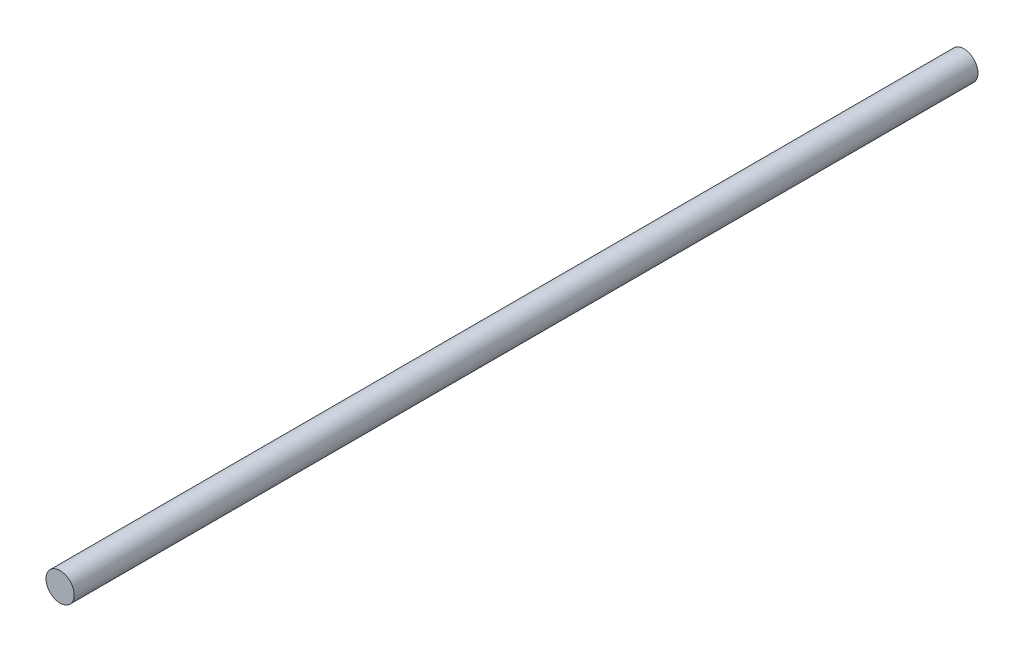
ISO-10303-21;
HEADER;
FILE_DESCRIPTION(('STEP AP214'),'2;1');
FILE_NAME('part.step','',(''),(''),'','','');
FILE_SCHEMA(('AUTOMOTIVE_DESIGN { 1 0 10303 214 1 1 1 1 }'));
ENDSEC;
DATA;
#1=APPLICATION_CONTEXT('core data for automotive mechanical design processes');
#2=APPLICATION_PROTOCOL_DEFINITION('international standard','automotive_design',2000,#1);
#3=PRODUCT_CONTEXT('',#1,'mechanical');
#4=PRODUCT('Part','Part','',(#3));
#5=PRODUCT_RELATED_PRODUCT_CATEGORY('part','',(#4));
#6=PRODUCT_DEFINITION_FORMATION('','',#4);
#7=PRODUCT_DEFINITION_CONTEXT('part definition',#1,'design');
#8=PRODUCT_DEFINITION('design','',#6,#7);
#9=PRODUCT_DEFINITION_SHAPE('','',#8);
#10=(LENGTH_UNIT() NAMED_UNIT(*) SI_UNIT(.MILLI.,.METRE.));
#11=(NAMED_UNIT(*) PLANE_ANGLE_UNIT() SI_UNIT($,.RADIAN.));
#12=(NAMED_UNIT(*) SI_UNIT($,.STERADIAN.) SOLID_ANGLE_UNIT());
#13=UNCERTAINTY_MEASURE_WITH_UNIT(LENGTH_MEASURE(1.E-05),#10,'distance_accuracy_value','');
#14=(GEOMETRIC_REPRESENTATION_CONTEXT(3) GLOBAL_UNCERTAINTY_ASSIGNED_CONTEXT((#13)) GLOBAL_UNIT_ASSIGNED_CONTEXT((#10,
#11,#12)) REPRESENTATION_CONTEXT('',''));
#15=CARTESIAN_POINT('',(0.,0.,0.));
#16=DIRECTION('',(0.,0.,1.));
#17=DIRECTION('',(1.,0.,0.));
#18=AXIS2_PLACEMENT_3D('',#15,#16,#17);
#19=CARTESIAN_POINT('',(0.,0.,203.2));
#20=DIRECTION('',(0.,0.,-1.));
#21=DIRECTION('',(-1.,0.,0.));
#22=AXIS2_PLACEMENT_3D('',#19,#20,#21);
#23=CYLINDRICAL_SURFACE('',#22,3.175);
#24=CARTESIAN_POINT('',(0.,0.,203.2));
#25=DIRECTION('',(0.,0.,1.));
#26=DIRECTION('',(1.,0.,0.));
#27=AXIS2_PLACEMENT_3D('',#24,#25,#26);
#28=CIRCLE('',#27,3.175);
#29=CARTESIAN_POINT('',(3.175,0.,203.2));
#30=VERTEX_POINT('',#29);
#31=EDGE_CURVE('E10',#30,#30,#28,.T.);
#32=ORIENTED_EDGE('',*,*,#31,.F.);
#33=EDGE_LOOP('',(#32));
#34=FACE_BOUND('',#33,.T.);
#35=CARTESIAN_POINT('',(0.,0.,0.));
#36=DIRECTION('',(0.,0.,1.));
#37=DIRECTION('',(1.,0.,0.));
#38=AXIS2_PLACEMENT_3D('',#35,#36,#37);
#39=CIRCLE('',#38,3.175);
#40=CARTESIAN_POINT('',(3.175,0.,0.));
#41=VERTEX_POINT('',#40);
#42=EDGE_CURVE('E35',#41,#41,#39,.T.);
#43=ORIENTED_EDGE('',*,*,#42,.T.);
#44=EDGE_LOOP('',(#43));
#45=FACE_BOUND('',#44,.T.);
#46=ADVANCED_FACE('F32',(#34,#45),#23,.T.);
#47=CARTESIAN_POINT('',(0.,0.,203.2));
#48=DIRECTION('',(0.,0.,1.));
#49=DIRECTION('',(1.,0.,0.));
#50=AXIS2_PLACEMENT_3D('',#47,#48,#49);
#51=PLANE('',#50);
#52=ORIENTED_EDGE('',*,*,#31,.T.);
#53=EDGE_LOOP('',(#52));
#54=FACE_BOUND('',#53,.T.);
#55=ADVANCED_FACE('F47',(#54),#51,.T.);
#56=CARTESIAN_POINT('',(0.,0.,0.));
#57=DIRECTION('',(0.,0.,1.));
#58=DIRECTION('',(1.,0.,0.));
#59=AXIS2_PLACEMENT_3D('',#56,#57,#58);
#60=PLANE('',#59);
#61=ORIENTED_EDGE('',*,*,#42,.F.);
#62=EDGE_LOOP('',(#61));
#63=FACE_BOUND('',#62,.T.);
#64=ADVANCED_FACE('F45',(#63),#60,.F.);
#65=CLOSED_SHELL('',(#46,#55,#64));
#66=MANIFOLD_SOLID_BREP('B2',#65);
#67=ADVANCED_BREP_SHAPE_REPRESENTATION('',(#18,#66),#14);
#68=SHAPE_DEFINITION_REPRESENTATION(#9,#67);
ENDSEC;
END-ISO-10303-21;
